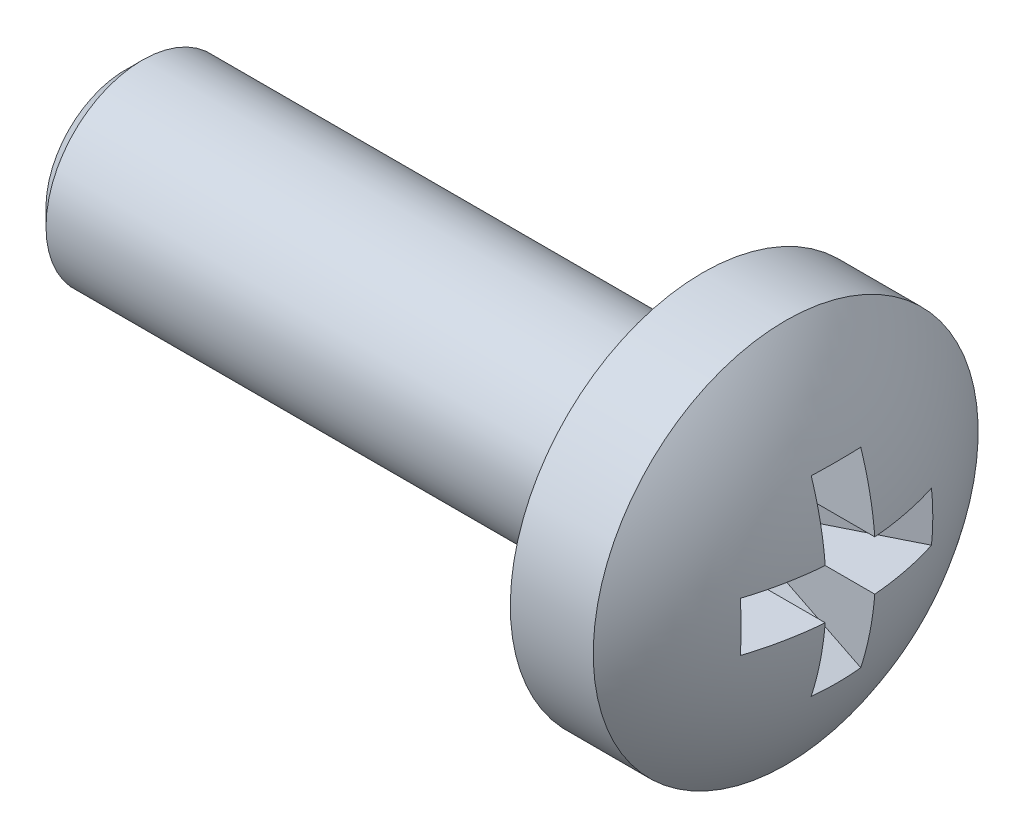
ISO-10303-21;
HEADER;
FILE_DESCRIPTION(('STEP AP214'),'2;1');
FILE_NAME('part.step','',(''),(''),'','','');
FILE_SCHEMA(('AUTOMOTIVE_DESIGN { 1 0 10303 214 1 1 1 1 }'));
ENDSEC;
DATA;
#1=APPLICATION_CONTEXT('core data for automotive mechanical design processes');
#2=APPLICATION_PROTOCOL_DEFINITION('international standard','automotive_design',2000,#1);
#3=PRODUCT_CONTEXT('',#1,'mechanical');
#4=PRODUCT('Part','Part','',(#3));
#5=PRODUCT_RELATED_PRODUCT_CATEGORY('part','',(#4));
#6=PRODUCT_DEFINITION_FORMATION('','',#4);
#7=PRODUCT_DEFINITION_CONTEXT('part definition',#1,'design');
#8=PRODUCT_DEFINITION('design','',#6,#7);
#9=PRODUCT_DEFINITION_SHAPE('','',#8);
#10=(LENGTH_UNIT() NAMED_UNIT(*) SI_UNIT(.MILLI.,.METRE.));
#11=(NAMED_UNIT(*) PLANE_ANGLE_UNIT() SI_UNIT($,.RADIAN.));
#12=(NAMED_UNIT(*) SI_UNIT($,.STERADIAN.) SOLID_ANGLE_UNIT());
#13=UNCERTAINTY_MEASURE_WITH_UNIT(LENGTH_MEASURE(1.E-05),#10,'distance_accuracy_value','');
#14=(GEOMETRIC_REPRESENTATION_CONTEXT(3) GLOBAL_UNCERTAINTY_ASSIGNED_CONTEXT((#13)) GLOBAL_UNIT_ASSIGNED_CONTEXT((#10,
#11,#12)) REPRESENTATION_CONTEXT('',''));
#15=CARTESIAN_POINT('',(0.,0.,0.));
#16=DIRECTION('',(0.,0.,1.));
#17=DIRECTION('',(1.,0.,0.));
#18=AXIS2_PLACEMENT_3D('',#15,#16,#17);
#19=CARTESIAN_POINT('',(-6.5,0.,0.));
#20=DIRECTION('',(1.,0.,0.));
#21=DIRECTION('',(0.,-1.,0.));
#22=AXIS2_PLACEMENT_3D('',#19,#20,#21);
#23=SPHERICAL_SURFACE('',#22,6.5);
#24=CARTESIAN_POINT('',(-6.06443199854499,0.,-0.873614257765256));
#25=DIRECTION('',(0.446197813109809,0.,-0.894934361602025));
#26=DIRECTION('',(-0.894934361602025,0.,-0.446197813109809));
#27=AXIS2_PLACEMENT_3D('',#24,#25,#26);
#28=CIRCLE('',#27,6.42628031171515);
#29=CARTESIAN_POINT('',(-0.331830512486634,0.515,1.98455540948322));
#30=VERTEX_POINT('',#29);
#31=CARTESIAN_POINT('',(-0.331830512486634,-0.515,1.98455540948322));
#32=VERTEX_POINT('',#31);
#33=EDGE_CURVE('E195',#30,#32,#28,.T.);
#34=ORIENTED_EDGE('',*,*,#33,.F.);
#35=CARTESIAN_POINT('',(-6.5,0.515,0.));
#36=DIRECTION('',(0.,-1.,0.));
#37=DIRECTION('',(0.,0.,-1.));
#38=AXIS2_PLACEMENT_3D('',#35,#36,#37);
#39=CIRCLE('',#38,6.47956595768575);
#40=CARTESIAN_POINT('',(-0.0409327298750029,0.515,0.515));
#41=VERTEX_POINT('',#40);
#42=EDGE_CURVE('E114',#30,#41,#39,.F.);
#43=ORIENTED_EDGE('',*,*,#42,.T.);
#44=CARTESIAN_POINT('',(-6.5,0.,0.515));
#45=DIRECTION('',(0.,0.,1.));
#46=DIRECTION('',(0.,-1.,0.));
#47=AXIS2_PLACEMENT_3D('',#44,#45,#46);
#48=CIRCLE('',#47,6.47956595768575);
#49=CARTESIAN_POINT('',(-0.331830512486634,1.98455540948322,0.515));
#50=VERTEX_POINT('',#49);
#51=EDGE_CURVE('E146',#50,#41,#48,.F.);
#52=ORIENTED_EDGE('',*,*,#51,.F.);
#53=CARTESIAN_POINT('',(-6.06443199854499,-0.873614257765256,0.));
#54=DIRECTION('',(0.446197813109809,-0.894934361602025,0.));
#55=DIRECTION('',(0.894934361602025,0.446197813109809,0.));
#56=AXIS2_PLACEMENT_3D('',#53,#54,#55);
#57=CIRCLE('',#56,6.42628031171515);
#58=CARTESIAN_POINT('',(-0.331830512486634,1.98455540948322,-0.515));
#59=VERTEX_POINT('',#58);
#60=EDGE_CURVE('E143',#50,#59,#57,.F.);
#61=ORIENTED_EDGE('',*,*,#60,.T.);
#62=CARTESIAN_POINT('',(-6.5,0.,-0.515));
#63=DIRECTION('',(0.,0.,1.));
#64=DIRECTION('',(0.,-1.,0.));
#65=AXIS2_PLACEMENT_3D('',#62,#63,#64);
#66=CIRCLE('',#65,6.47956595768575);
#67=CARTESIAN_POINT('',(-0.0409327298750029,0.515,-0.515));
#68=VERTEX_POINT('',#67);
#69=EDGE_CURVE('E147',#59,#68,#66,.F.);
#70=ORIENTED_EDGE('',*,*,#69,.T.);
#71=CARTESIAN_POINT('',(-6.5,0.515,0.));
#72=DIRECTION('',(0.,-1.,0.));
#73=DIRECTION('',(0.,0.,-1.));
#74=AXIS2_PLACEMENT_3D('',#71,#72,#73);
#75=CIRCLE('',#74,6.47956595768575);
#76=CARTESIAN_POINT('',(-0.331830512486634,0.515,-1.98455540948322));
#77=VERTEX_POINT('',#76);
#78=EDGE_CURVE('E197',#68,#77,#75,.F.);
#79=ORIENTED_EDGE('',*,*,#78,.T.);
#80=CARTESIAN_POINT('',(-6.06443199854499,0.,0.873614257765255));
#81=DIRECTION('',(0.446197813109809,0.,0.894934361602025));
#82=DIRECTION('',(0.894934361602025,0.,-0.446197813109809));
#83=AXIS2_PLACEMENT_3D('',#80,#81,#82);
#84=CIRCLE('',#83,6.42628031171515);
#85=CARTESIAN_POINT('',(-0.331830512486634,-0.515,-1.98455540948322));
#86=VERTEX_POINT('',#85);
#87=EDGE_CURVE('E200',#77,#86,#84,.F.);
#88=ORIENTED_EDGE('',*,*,#87,.T.);
#89=CARTESIAN_POINT('',(-6.5,-0.515,0.));
#90=DIRECTION('',(0.,-1.,0.));
#91=DIRECTION('',(0.,0.,-1.));
#92=AXIS2_PLACEMENT_3D('',#89,#90,#91);
#93=CIRCLE('',#92,6.47956595768575);
#94=CARTESIAN_POINT('',(-0.0409327298750029,-0.515,-0.515));
#95=VERTEX_POINT('',#94);
#96=EDGE_CURVE('E201',#95,#86,#93,.F.);
#97=ORIENTED_EDGE('',*,*,#96,.F.);
#98=CARTESIAN_POINT('',(-6.5,0.,-0.515));
#99=DIRECTION('',(0.,0.,1.));
#100=DIRECTION('',(0.,-1.,0.));
#101=AXIS2_PLACEMENT_3D('',#98,#99,#100);
#102=CIRCLE('',#101,6.47956595768575);
#103=CARTESIAN_POINT('',(-0.331830512486634,-1.98455540948322,-0.515));
#104=VERTEX_POINT('',#103);
#105=EDGE_CURVE('E157',#95,#104,#102,.F.);
#106=ORIENTED_EDGE('',*,*,#105,.T.);
#107=CARTESIAN_POINT('',(-6.06443199854499,0.873614257765256,0.));
#108=DIRECTION('',(0.446197813109809,0.894934361602025,0.));
#109=DIRECTION('',(-0.894934361602025,0.446197813109809,0.));
#110=AXIS2_PLACEMENT_3D('',#107,#108,#109);
#111=CIRCLE('',#110,6.42628031171515);
#112=CARTESIAN_POINT('',(-0.331830512486634,-1.98455540948322,0.515));
#113=VERTEX_POINT('',#112);
#114=EDGE_CURVE('E154',#113,#104,#111,.T.);
#115=ORIENTED_EDGE('',*,*,#114,.F.);
#116=CARTESIAN_POINT('',(-6.5,0.,0.515));
#117=DIRECTION('',(0.,0.,1.));
#118=DIRECTION('',(0.,-1.,0.));
#119=AXIS2_PLACEMENT_3D('',#116,#117,#118);
#120=CIRCLE('',#119,6.47956595768575);
#121=CARTESIAN_POINT('',(-0.0409327298750029,-0.515,0.515));
#122=VERTEX_POINT('',#121);
#123=EDGE_CURVE('E158',#122,#113,#120,.F.);
#124=ORIENTED_EDGE('',*,*,#123,.F.);
#125=CARTESIAN_POINT('',(-6.5,-0.515,0.));
#126=DIRECTION('',(0.,-1.,0.));
#127=DIRECTION('',(0.,0.,-1.));
#128=AXIS2_PLACEMENT_3D('',#125,#126,#127);
#129=CIRCLE('',#128,6.47956595768575);
#130=EDGE_CURVE('E193',#32,#122,#129,.F.);
#131=ORIENTED_EDGE('',*,*,#130,.F.);
#132=EDGE_LOOP('',(#34,#43,#52,#61,#70,#79,#88,#97,#106,#115,#124,#131));
#133=FACE_BOUND('',#132,.T.);
#134=CARTESIAN_POINT('',(-1.3765246170202,0.,0.));
#135=DIRECTION('',(1.,0.,0.));
#136=DIRECTION('',(0.,1.,0.));
#137=AXIS2_PLACEMENT_3D('',#134,#135,#136);
#138=CIRCLE('',#137,4.);
#139=CARTESIAN_POINT('',(-1.3765246170202,4.,0.));
#140=VERTEX_POINT('',#139);
#141=EDGE_CURVE('E118',#140,#140,#138,.T.);
#142=ORIENTED_EDGE('',*,*,#141,.T.);
#143=EDGE_LOOP('',(#142));
#144=FACE_BOUND('',#143,.T.);
#145=ADVANCED_FACE('F16',(#133,#144),#23,.T.);
#146=CARTESIAN_POINT('',(-15.1,0.,0.));
#147=DIRECTION('',(-1.,0.,0.));
#148=DIRECTION('',(0.,-1.,0.));
#149=AXIS2_PLACEMENT_3D('',#146,#147,#148);
#150=PLANE('',#149);
#151=CARTESIAN_POINT('',(-15.1,0.,0.));
#152=DIRECTION('',(-1.,0.,0.));
#153=DIRECTION('',(0.,-1.,0.));
#154=AXIS2_PLACEMENT_3D('',#151,#152,#153);
#155=CIRCLE('',#154,1.65);
#156=CARTESIAN_POINT('',(-15.1,-1.65,0.));
#157=VERTEX_POINT('',#156);
#158=EDGE_CURVE('E10',#157,#157,#155,.T.);
#159=ORIENTED_EDGE('',*,*,#158,.T.);
#160=EDGE_LOOP('',(#159));
#161=FACE_BOUND('',#160,.T.);
#162=ADVANCED_FACE('F262',(#161),#150,.T.);
#163=CARTESIAN_POINT('',(0.,0.,0.));
#164=DIRECTION('',(1.,0.,0.));
#165=DIRECTION('',(0.,1.,0.));
#166=AXIS2_PLACEMENT_3D('',#163,#164,#165);
#167=CYLINDRICAL_SURFACE('',#166,2.);
#168=CARTESIAN_POINT('',(-14.75,0.,0.));
#169=DIRECTION('',(-1.,0.,0.));
#170=DIRECTION('',(0.,-1.,0.));
#171=AXIS2_PLACEMENT_3D('',#168,#169,#170);
#172=CIRCLE('',#171,2.);
#173=CARTESIAN_POINT('',(-14.75,-2.,0.));
#174=VERTEX_POINT('',#173);
#175=EDGE_CURVE('E26',#174,#174,#172,.F.);
#176=ORIENTED_EDGE('',*,*,#175,.T.);
#177=EDGE_LOOP('',(#176));
#178=FACE_BOUND('',#177,.T.);
#179=CARTESIAN_POINT('',(-3.1,0.,0.));
#180=DIRECTION('',(1.,0.,0.));
#181=DIRECTION('',(0.,1.,0.));
#182=AXIS2_PLACEMENT_3D('',#179,#180,#181);
#183=CIRCLE('',#182,2.);
#184=CARTESIAN_POINT('',(-3.1,2.,0.));
#185=VERTEX_POINT('',#184);
#186=EDGE_CURVE('E190',#185,#185,#183,.T.);
#187=ORIENTED_EDGE('',*,*,#186,.F.);
#188=EDGE_LOOP('',(#187));
#189=FACE_BOUND('',#188,.T.);
#190=ADVANCED_FACE('F268',(#178,#189),#167,.T.);
#191=CARTESIAN_POINT('',(-3.1,2.,0.));
#192=DIRECTION('',(-1.,0.,0.));
#193=DIRECTION('',(0.,-1.,0.));
#194=AXIS2_PLACEMENT_3D('',#191,#192,#193);
#195=PLANE('',#194);
#196=ORIENTED_EDGE('',*,*,#186,.T.);
#197=EDGE_LOOP('',(#196));
#198=FACE_BOUND('',#197,.T.);
#199=CARTESIAN_POINT('',(-3.1,0.,0.));
#200=DIRECTION('',(1.,0.,0.));
#201=DIRECTION('',(0.,1.,0.));
#202=AXIS2_PLACEMENT_3D('',#199,#200,#201);
#203=CIRCLE('',#202,4.);
#204=CARTESIAN_POINT('',(-3.1,4.,0.));
#205=VERTEX_POINT('',#204);
#206=EDGE_CURVE('E187',#205,#205,#203,.T.);
#207=ORIENTED_EDGE('',*,*,#206,.F.);
#208=EDGE_LOOP('',(#207));
#209=FACE_BOUND('',#208,.T.);
#210=ADVANCED_FACE('F299',(#198,#209),#195,.T.);
#211=CARTESIAN_POINT('',(0.,0.,0.));
#212=DIRECTION('',(1.,0.,0.));
#213=DIRECTION('',(0.,1.,0.));
#214=AXIS2_PLACEMENT_3D('',#211,#212,#213);
#215=CYLINDRICAL_SURFACE('',#214,4.);
#216=ORIENTED_EDGE('',*,*,#206,.T.);
#217=EDGE_LOOP('',(#216));
#218=FACE_BOUND('',#217,.T.);
#219=ORIENTED_EDGE('',*,*,#141,.F.);
#220=EDGE_LOOP('',(#219));
#221=FACE_BOUND('',#220,.T.);
#222=ADVANCED_FACE('F296',(#218,#221),#215,.T.);
#223=CARTESIAN_POINT('',(0.,0.,2.15));
#224=DIRECTION('',(0.446197813109809,0.,-0.894934361602025));
#225=DIRECTION('',(-0.894934361602025,0.,-0.446197813109809));
#226=AXIS2_PLACEMENT_3D('',#223,#224,#225);
#227=PLANE('',#226);
#228=ORIENTED_EDGE('',*,*,#33,.T.);
#229=DIRECTION('',(-0.894934361602025,0.,-0.44619781310981));
#230=VECTOR('',#229,1.);
#231=CARTESIAN_POINT('',(0.,-0.515,2.15));
#232=LINE('',#231,#230);
#233=CARTESIAN_POINT('',(-2.34,-0.515,0.983319037154967));
#234=VERTEX_POINT('',#233);
#235=EDGE_CURVE('E35',#234,#32,#232,.F.);
#236=ORIENTED_EDGE('',*,*,#235,.F.);
#237=DIRECTION('',(0.,1.,0.));
#238=VECTOR('',#237,1.);
#239=CARTESIAN_POINT('',(-2.34,0.,0.983319037154967));
#240=LINE('',#239,#238);
#241=CARTESIAN_POINT('',(-2.34,0.515,0.983319037154967));
#242=VERTEX_POINT('',#241);
#243=EDGE_CURVE('E126',#242,#234,#240,.F.);
#244=ORIENTED_EDGE('',*,*,#243,.F.);
#245=DIRECTION('',(-0.894934361602025,0.,-0.44619781310981));
#246=VECTOR('',#245,1.);
#247=CARTESIAN_POINT('',(0.,0.515,2.15));
#248=LINE('',#247,#246);
#249=EDGE_CURVE('E107',#242,#30,#248,.F.);
#250=ORIENTED_EDGE('',*,*,#249,.T.);
#251=EDGE_LOOP('',(#228,#236,#244,#250));
#252=FACE_BOUND('',#251,.T.);
#253=ADVANCED_FACE('F18',(#252),#227,.T.);
#254=CARTESIAN_POINT('',(-2.34,0.515,0.));
#255=DIRECTION('',(0.,-1.,0.));
#256=DIRECTION('',(0.,0.,-1.));
#257=AXIS2_PLACEMENT_3D('',#254,#255,#256);
#258=PLANE('',#257);
#259=ORIENTED_EDGE('',*,*,#249,.F.);
#260=DIRECTION('',(0.,0.,-1.));
#261=VECTOR('',#260,1.);
#262=CARTESIAN_POINT('',(-2.34,0.515,0.));
#263=LINE('',#262,#261);
#264=CARTESIAN_POINT('',(-2.34,0.515,0.515));
#265=VERTEX_POINT('',#264);
#266=EDGE_CURVE('E111',#242,#265,#263,.T.);
#267=ORIENTED_EDGE('',*,*,#266,.T.);
#268=DIRECTION('',(1.,0.,0.));
#269=VECTOR('',#268,1.);
#270=CARTESIAN_POINT('',(-2.34,0.515,0.515));
#271=LINE('',#270,#269);
#272=EDGE_CURVE('E119',#265,#41,#271,.T.);
#273=ORIENTED_EDGE('',*,*,#272,.T.);
#274=ORIENTED_EDGE('',*,*,#42,.F.);
#275=EDGE_LOOP('',(#259,#267,#273,#274));
#276=FACE_BOUND('',#275,.T.);
#277=ADVANCED_FACE('F109',(#276),#258,.T.);
#278=CARTESIAN_POINT('',(-2.34,0.,0.515));
#279=DIRECTION('',(0.,0.,1.));
#280=DIRECTION('',(0.,-1.,0.));
#281=AXIS2_PLACEMENT_3D('',#278,#279,#280);
#282=PLANE('',#281);
#283=ORIENTED_EDGE('',*,*,#51,.T.);
#284=ORIENTED_EDGE('',*,*,#272,.F.);
#285=DIRECTION('',(0.,-1.,0.));
#286=VECTOR('',#285,1.);
#287=CARTESIAN_POINT('',(-2.34,0.,0.515));
#288=LINE('',#287,#286);
#289=CARTESIAN_POINT('',(-2.34,0.983319037154967,0.515));
#290=VERTEX_POINT('',#289);
#291=EDGE_CURVE('E129',#290,#265,#288,.T.);
#292=ORIENTED_EDGE('',*,*,#291,.F.);
#293=DIRECTION('',(0.894934361602025,0.44619781310981,0.));
#294=VECTOR('',#293,1.);
#295=CARTESIAN_POINT('',(-2.73265675038874,0.787547603133116,0.515));
#296=LINE('',#295,#294);
#297=EDGE_CURVE('E139',#290,#50,#296,.T.);
#298=ORIENTED_EDGE('',*,*,#297,.T.);
#299=EDGE_LOOP('',(#283,#284,#292,#298));
#300=FACE_BOUND('',#299,.T.);
#301=ADVANCED_FACE('F250',(#300),#282,.F.);
#302=CARTESIAN_POINT('',(0.,2.15,0.));
#303=DIRECTION('',(0.446197813109809,-0.894934361602025,0.));
#304=DIRECTION('',(0.894934361602025,0.446197813109809,0.));
#305=AXIS2_PLACEMENT_3D('',#302,#303,#304);
#306=PLANE('',#305);
#307=ORIENTED_EDGE('',*,*,#297,.F.);
#308=DIRECTION('',(0.,0.,-1.));
#309=VECTOR('',#308,1.);
#310=CARTESIAN_POINT('',(-2.34,0.983319037154967,0.));
#311=LINE('',#310,#309);
#312=CARTESIAN_POINT('',(-2.34,0.983319037154967,-0.515));
#313=VERTEX_POINT('',#312);
#314=EDGE_CURVE('E151',#290,#313,#311,.T.);
#315=ORIENTED_EDGE('',*,*,#314,.T.);
#316=DIRECTION('',(0.894934361602025,0.44619781310981,0.));
#317=VECTOR('',#316,1.);
#318=CARTESIAN_POINT('',(-2.73265675038874,0.787547603133116,-0.515));
#319=LINE('',#318,#317);
#320=EDGE_CURVE('E142',#313,#59,#319,.T.);
#321=ORIENTED_EDGE('',*,*,#320,.T.);
#322=ORIENTED_EDGE('',*,*,#60,.F.);
#323=EDGE_LOOP('',(#307,#315,#321,#322));
#324=FACE_BOUND('',#323,.T.);
#325=ADVANCED_FACE('F248',(#324),#306,.T.);
#326=CARTESIAN_POINT('',(-2.34,0.,-0.515));
#327=DIRECTION('',(0.,0.,1.));
#328=DIRECTION('',(0.,-1.,0.));
#329=AXIS2_PLACEMENT_3D('',#326,#327,#328);
#330=PLANE('',#329);
#331=ORIENTED_EDGE('',*,*,#320,.F.);
#332=DIRECTION('',(0.,-1.,0.));
#333=VECTOR('',#332,1.);
#334=CARTESIAN_POINT('',(-2.34,0.,-0.515));
#335=LINE('',#334,#333);
#336=CARTESIAN_POINT('',(-2.34,0.515,-0.515));
#337=VERTEX_POINT('',#336);
#338=EDGE_CURVE('E153',#313,#337,#335,.T.);
#339=ORIENTED_EDGE('',*,*,#338,.T.);
#340=DIRECTION('',(1.,0.,0.));
#341=VECTOR('',#340,1.);
#342=CARTESIAN_POINT('',(-2.34,0.515,-0.515));
#343=LINE('',#342,#341);
#344=EDGE_CURVE('E150',#337,#68,#343,.T.);
#345=ORIENTED_EDGE('',*,*,#344,.T.);
#346=ORIENTED_EDGE('',*,*,#69,.F.);
#347=EDGE_LOOP('',(#331,#339,#345,#346));
#348=FACE_BOUND('',#347,.T.);
#349=ADVANCED_FACE('F245',(#348),#330,.T.);
#350=CARTESIAN_POINT('',(-2.34,0.515,0.));
#351=DIRECTION('',(0.,-1.,0.));
#352=DIRECTION('',(0.,0.,-1.));
#353=AXIS2_PLACEMENT_3D('',#350,#351,#352);
#354=PLANE('',#353);
#355=ORIENTED_EDGE('',*,*,#344,.F.);
#356=DIRECTION('',(0.,0.,-1.));
#357=VECTOR('',#356,1.);
#358=CARTESIAN_POINT('',(-2.34,0.515,0.));
#359=LINE('',#358,#357);
#360=CARTESIAN_POINT('',(-2.34,0.515,-0.983319037154968));
#361=VERTEX_POINT('',#360);
#362=EDGE_CURVE('E173',#337,#361,#359,.T.);
#363=ORIENTED_EDGE('',*,*,#362,.T.);
#364=DIRECTION('',(0.894934361602025,0.,-0.44619781310981));
#365=VECTOR('',#364,1.);
#366=CARTESIAN_POINT('',(0.,0.515,-2.15));
#367=LINE('',#366,#365);
#368=EDGE_CURVE('E180',#361,#77,#367,.T.);
#369=ORIENTED_EDGE('',*,*,#368,.T.);
#370=ORIENTED_EDGE('',*,*,#78,.F.);
#371=EDGE_LOOP('',(#355,#363,#369,#370));
#372=FACE_BOUND('',#371,.T.);
#373=ADVANCED_FACE('F242',(#372),#354,.T.);
#374=CARTESIAN_POINT('',(0.,0.,-2.15));
#375=DIRECTION('',(0.446197813109809,0.,0.894934361602025));
#376=DIRECTION('',(0.894934361602025,0.,-0.446197813109809));
#377=AXIS2_PLACEMENT_3D('',#374,#375,#376);
#378=PLANE('',#377);
#379=ORIENTED_EDGE('',*,*,#368,.F.);
#380=DIRECTION('',(0.,-1.,0.));
#381=VECTOR('',#380,1.);
#382=CARTESIAN_POINT('',(-2.34,0.,-0.983319037154968));
#383=LINE('',#382,#381);
#384=CARTESIAN_POINT('',(-2.34,-0.515,-0.983319037154968));
#385=VERTEX_POINT('',#384);
#386=EDGE_CURVE('E172',#361,#385,#383,.T.);
#387=ORIENTED_EDGE('',*,*,#386,.T.);
#388=DIRECTION('',(0.894934361602025,0.,-0.44619781310981));
#389=VECTOR('',#388,1.);
#390=CARTESIAN_POINT('',(0.,-0.515,-2.15));
#391=LINE('',#390,#389);
#392=EDGE_CURVE('E182',#385,#86,#391,.T.);
#393=ORIENTED_EDGE('',*,*,#392,.T.);
#394=ORIENTED_EDGE('',*,*,#87,.F.);
#395=EDGE_LOOP('',(#379,#387,#393,#394));
#396=FACE_BOUND('',#395,.T.);
#397=ADVANCED_FACE('F236',(#396),#378,.T.);
#398=CARTESIAN_POINT('',(-2.34,-0.515,0.));
#399=DIRECTION('',(0.,-1.,0.));
#400=DIRECTION('',(0.,0.,-1.));
#401=AXIS2_PLACEMENT_3D('',#398,#399,#400);
#402=PLANE('',#401);
#403=ORIENTED_EDGE('',*,*,#96,.T.);
#404=ORIENTED_EDGE('',*,*,#392,.F.);
#405=DIRECTION('',(0.,0.,-1.));
#406=VECTOR('',#405,1.);
#407=CARTESIAN_POINT('',(-2.34,-0.515,0.));
#408=LINE('',#407,#406);
#409=CARTESIAN_POINT('',(-2.34,-0.515,-0.515));
#410=VERTEX_POINT('',#409);
#411=EDGE_CURVE('E165',#410,#385,#408,.T.);
#412=ORIENTED_EDGE('',*,*,#411,.F.);
#413=DIRECTION('',(1.,0.,0.));
#414=VECTOR('',#413,1.);
#415=CARTESIAN_POINT('',(-2.34,-0.515,-0.515));
#416=LINE('',#415,#414);
#417=EDGE_CURVE('E79',#410,#95,#416,.T.);
#418=ORIENTED_EDGE('',*,*,#417,.T.);
#419=EDGE_LOOP('',(#403,#404,#412,#418));
#420=FACE_BOUND('',#419,.T.);
#421=ADVANCED_FACE('F232',(#420),#402,.F.);
#422=CARTESIAN_POINT('',(-2.34,0.,-0.515));
#423=DIRECTION('',(0.,0.,1.));
#424=DIRECTION('',(0.,-1.,0.));
#425=AXIS2_PLACEMENT_3D('',#422,#423,#424);
#426=PLANE('',#425);
#427=ORIENTED_EDGE('',*,*,#417,.F.);
#428=DIRECTION('',(0.,-1.,0.));
#429=VECTOR('',#428,1.);
#430=CARTESIAN_POINT('',(-2.34,0.,-0.515));
#431=LINE('',#430,#429);
#432=CARTESIAN_POINT('',(-2.34,-0.983319037154967,-0.515));
#433=VERTEX_POINT('',#432);
#434=EDGE_CURVE('E73',#410,#433,#431,.T.);
#435=ORIENTED_EDGE('',*,*,#434,.T.);
#436=DIRECTION('',(-0.894934361602025,0.44619781310981,0.));
#437=VECTOR('',#436,1.);
#438=CARTESIAN_POINT('',(-2.73265675038874,-0.787547603133116,-0.515));
#439=LINE('',#438,#437);
#440=EDGE_CURVE('E20',#433,#104,#439,.F.);
#441=ORIENTED_EDGE('',*,*,#440,.T.);
#442=ORIENTED_EDGE('',*,*,#105,.F.);
#443=EDGE_LOOP('',(#427,#435,#441,#442));
#444=FACE_BOUND('',#443,.T.);
#445=ADVANCED_FACE('F228',(#444),#426,.T.);
#446=CARTESIAN_POINT('',(0.,-2.15,0.));
#447=DIRECTION('',(0.446197813109809,0.894934361602025,0.));
#448=DIRECTION('',(-0.894934361602025,0.446197813109809,0.));
#449=AXIS2_PLACEMENT_3D('',#446,#447,#448);
#450=PLANE('',#449);
#451=ORIENTED_EDGE('',*,*,#114,.T.);
#452=ORIENTED_EDGE('',*,*,#440,.F.);
#453=DIRECTION('',(0.,0.,1.));
#454=VECTOR('',#453,1.);
#455=CARTESIAN_POINT('',(-2.34,-0.983319037154967,0.));
#456=LINE('',#455,#454);
#457=CARTESIAN_POINT('',(-2.34,-0.983319037154967,0.515));
#458=VERTEX_POINT('',#457);
#459=EDGE_CURVE('E161',#458,#433,#456,.F.);
#460=ORIENTED_EDGE('',*,*,#459,.F.);
#461=DIRECTION('',(-0.894934361602025,0.44619781310981,0.));
#462=VECTOR('',#461,1.);
#463=CARTESIAN_POINT('',(-2.73265675038874,-0.787547603133116,0.515));
#464=LINE('',#463,#462);
#465=EDGE_CURVE('E159',#458,#113,#464,.F.);
#466=ORIENTED_EDGE('',*,*,#465,.T.);
#467=EDGE_LOOP('',(#451,#452,#460,#466));
#468=FACE_BOUND('',#467,.T.);
#469=ADVANCED_FACE('F227',(#468),#450,.T.);
#470=CARTESIAN_POINT('',(-2.34,0.,0.515));
#471=DIRECTION('',(0.,0.,1.));
#472=DIRECTION('',(0.,-1.,0.));
#473=AXIS2_PLACEMENT_3D('',#470,#471,#472);
#474=PLANE('',#473);
#475=ORIENTED_EDGE('',*,*,#123,.T.);
#476=ORIENTED_EDGE('',*,*,#465,.F.);
#477=DIRECTION('',(0.,-1.,0.));
#478=VECTOR('',#477,1.);
#479=CARTESIAN_POINT('',(-2.34,0.,0.515));
#480=LINE('',#479,#478);
#481=CARTESIAN_POINT('',(-2.34,-0.515,0.515));
#482=VERTEX_POINT('',#481);
#483=EDGE_CURVE('E133',#482,#458,#480,.T.);
#484=ORIENTED_EDGE('',*,*,#483,.F.);
#485=DIRECTION('',(1.,0.,0.));
#486=VECTOR('',#485,1.);
#487=CARTESIAN_POINT('',(-2.34,-0.515,0.515));
#488=LINE('',#487,#486);
#489=EDGE_CURVE('E138',#482,#122,#488,.T.);
#490=ORIENTED_EDGE('',*,*,#489,.T.);
#491=EDGE_LOOP('',(#475,#476,#484,#490));
#492=FACE_BOUND('',#491,.T.);
#493=ADVANCED_FACE('F225',(#492),#474,.F.);
#494=CARTESIAN_POINT('',(-2.34,-0.515,0.));
#495=DIRECTION('',(0.,-1.,0.));
#496=DIRECTION('',(0.,0.,-1.));
#497=AXIS2_PLACEMENT_3D('',#494,#495,#496);
#498=PLANE('',#497);
#499=ORIENTED_EDGE('',*,*,#130,.T.);
#500=ORIENTED_EDGE('',*,*,#489,.F.);
#501=DIRECTION('',(0.,0.,-1.));
#502=VECTOR('',#501,1.);
#503=CARTESIAN_POINT('',(-2.34,-0.515,0.));
#504=LINE('',#503,#502);
#505=EDGE_CURVE('E131',#234,#482,#504,.T.);
#506=ORIENTED_EDGE('',*,*,#505,.F.);
#507=ORIENTED_EDGE('',*,*,#235,.T.);
#508=EDGE_LOOP('',(#499,#500,#506,#507));
#509=FACE_BOUND('',#508,.T.);
#510=ADVANCED_FACE('F223',(#509),#498,.F.);
#511=CARTESIAN_POINT('',(-2.34,0.,0.));
#512=DIRECTION('',(1.,0.,0.));
#513=DIRECTION('',(0.,0.,-1.));
#514=AXIS2_PLACEMENT_3D('',#511,#512,#513);
#515=PLANE('',#514);
#516=ORIENTED_EDGE('',*,*,#243,.T.);
#517=ORIENTED_EDGE('',*,*,#505,.T.);
#518=ORIENTED_EDGE('',*,*,#483,.T.);
#519=ORIENTED_EDGE('',*,*,#459,.T.);
#520=ORIENTED_EDGE('',*,*,#434,.F.);
#521=ORIENTED_EDGE('',*,*,#411,.T.);
#522=ORIENTED_EDGE('',*,*,#386,.F.);
#523=ORIENTED_EDGE('',*,*,#362,.F.);
#524=ORIENTED_EDGE('',*,*,#338,.F.);
#525=ORIENTED_EDGE('',*,*,#314,.F.);
#526=ORIENTED_EDGE('',*,*,#291,.T.);
#527=ORIENTED_EDGE('',*,*,#266,.F.);
#528=EDGE_LOOP('',(#516,#517,#518,#519,#520,#521,#522,#523,#524,#525,#526,#527));
#529=FACE_BOUND('',#528,.T.);
#530=ADVANCED_FACE('F124',(#529),#515,.T.);
#531=CARTESIAN_POINT('',(-14.75,0.,0.));
#532=DIRECTION('',(1.,0.,0.));
#533=DIRECTION('',(0.,1.,0.));
#534=AXIS2_PLACEMENT_3D('',#531,#532,#533);
#535=CONICAL_SURFACE('',#534,2.,0.785398163397455);
#536=ORIENTED_EDGE('',*,*,#158,.F.);
#537=EDGE_LOOP('',(#536));
#538=FACE_BOUND('',#537,.T.);
#539=ORIENTED_EDGE('',*,*,#175,.F.);
#540=EDGE_LOOP('',(#539));
#541=FACE_BOUND('',#540,.T.);
#542=ADVANCED_FACE('F273',(#538,#541),#535,.T.);
#543=CLOSED_SHELL('',(#145,#162,#190,#210,#222,#253,#277,#301,#325,#349,#373,#397,#421,#445,
#469,#493,#510,#530,#542));
#544=MANIFOLD_SOLID_BREP('B1',#543);
#545=ADVANCED_BREP_SHAPE_REPRESENTATION('',(#18,#544),#14);
#546=SHAPE_DEFINITION_REPRESENTATION(#9,#545);
ENDSEC;
END-ISO-10303-21;
